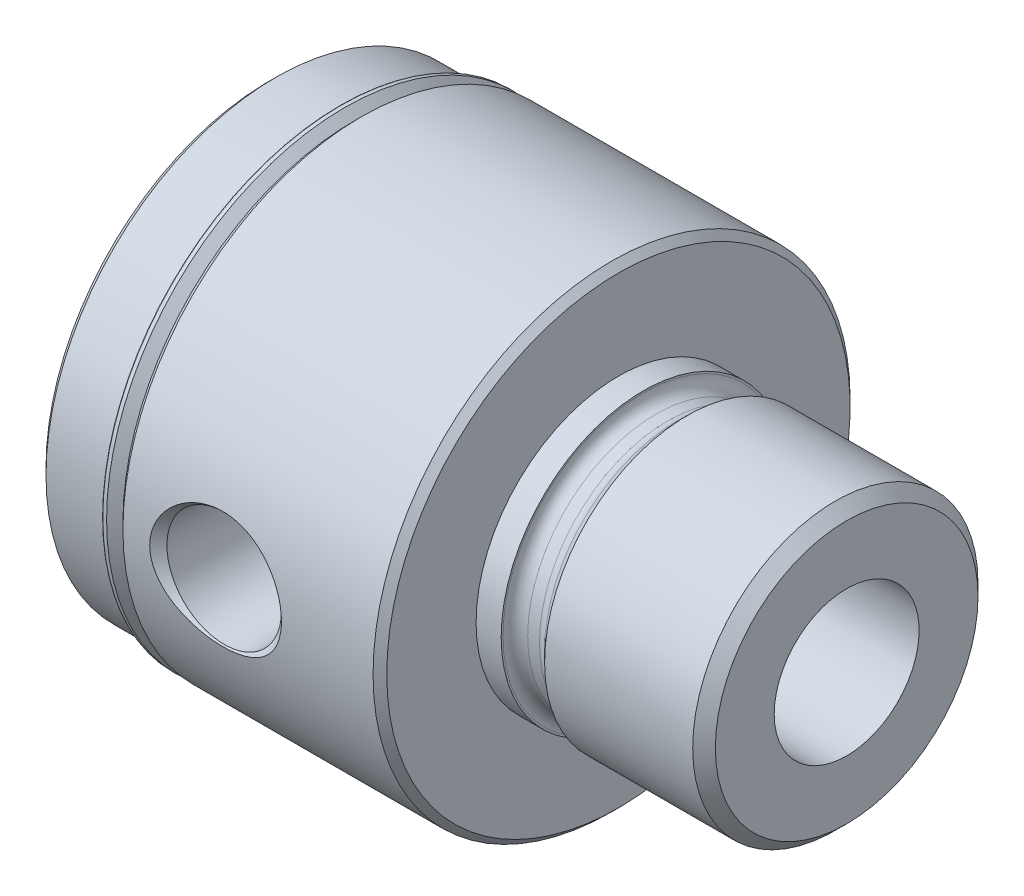
ISO-10303-21;
HEADER;
FILE_DESCRIPTION(('STEP AP214'),'2;1');
FILE_NAME('part.step','',(''),(''),'','','');
FILE_SCHEMA(('AUTOMOTIVE_DESIGN { 1 0 10303 214 1 1 1 1 }'));
ENDSEC;
DATA;
#1=APPLICATION_CONTEXT('core data for automotive mechanical design processes');
#2=APPLICATION_PROTOCOL_DEFINITION('international standard','automotive_design',2000,#1);
#3=PRODUCT_CONTEXT('',#1,'mechanical');
#4=PRODUCT('Part','Part','',(#3));
#5=PRODUCT_RELATED_PRODUCT_CATEGORY('part','',(#4));
#6=PRODUCT_DEFINITION_FORMATION('','',#4);
#7=PRODUCT_DEFINITION_CONTEXT('part definition',#1,'design');
#8=PRODUCT_DEFINITION('design','',#6,#7);
#9=PRODUCT_DEFINITION_SHAPE('','',#8);
#10=(LENGTH_UNIT() NAMED_UNIT(*) SI_UNIT(.MILLI.,.METRE.));
#11=(NAMED_UNIT(*) PLANE_ANGLE_UNIT() SI_UNIT($,.RADIAN.));
#12=(NAMED_UNIT(*) SI_UNIT($,.STERADIAN.) SOLID_ANGLE_UNIT());
#13=UNCERTAINTY_MEASURE_WITH_UNIT(LENGTH_MEASURE(1.E-05),#10,'distance_accuracy_value','');
#14=(GEOMETRIC_REPRESENTATION_CONTEXT(3) GLOBAL_UNCERTAINTY_ASSIGNED_CONTEXT((#13)) GLOBAL_UNIT_ASSIGNED_CONTEXT((#10,
#11,#12)) REPRESENTATION_CONTEXT('',''));
#15=CARTESIAN_POINT('',(0.,0.,0.));
#16=DIRECTION('',(0.,0.,1.));
#17=DIRECTION('',(1.,0.,0.));
#18=AXIS2_PLACEMENT_3D('',#15,#16,#17);
#19=CARTESIAN_POINT('',(25.3999999999999,14.6151600000002,0.));
#20=DIRECTION('',(-1.,0.,0.));
#21=DIRECTION('',(0.,0.,1.));
#22=AXIS2_PLACEMENT_3D('',#19,#20,#21);
#23=PLANE('',#22);
#24=CARTESIAN_POINT('',(25.3999999999997,0.,0.));
#25=DIRECTION('',(-1.,0.,0.));
#26=DIRECTION('',(0.,0.,1.));
#27=AXIS2_PLACEMENT_3D('',#24,#25,#26);
#28=CIRCLE('',#27,14.6151600000002);
#29=CARTESIAN_POINT('',(25.3999999999997,0.,14.6151600000002));
#30=VERTEX_POINT('',#29);
#31=EDGE_CURVE('E127',#30,#30,#28,.T.);
#32=ORIENTED_EDGE('',*,*,#31,.F.);
#33=EDGE_LOOP('',(#32));
#34=FACE_BOUND('',#33,.T.);
#35=CARTESIAN_POINT('',(25.3999999999999,0.,0.));
#36=DIRECTION('',(-1.,0.,0.));
#37=DIRECTION('',(0.,0.,1.));
#38=AXIS2_PLACEMENT_3D('',#35,#36,#37);
#39=CIRCLE('',#38,8.0645);
#40=CARTESIAN_POINT('',(25.3999999999999,0.,8.0645));
#41=VERTEX_POINT('',#40);
#42=EDGE_CURVE('E192',#41,#41,#39,.F.);
#43=ORIENTED_EDGE('',*,*,#42,.F.);
#44=EDGE_LOOP('',(#43));
#45=FACE_BOUND('',#44,.T.);
#46=ADVANCED_FACE('F37',(#34,#45),#23,.F.);
#47=CARTESIAN_POINT('',(-18.288,0.,25.585630358377));
#48=DIRECTION('',(0.,0.,1.));
#49=DIRECTION('',(1.,0.,0.));
#50=AXIS2_PLACEMENT_3D('',#47,#48,#49);
#51=CONICAL_SURFACE('',#50,6.372134104285,0.0312094049979733);
#52=CARTESIAN_POINT('',(-18.288,0.,25.585630358377));
#53=DIRECTION('',(0.,0.,-1.));
#54=DIRECTION('',(-1.,0.,0.));
#55=AXIS2_PLACEMENT_3D('',#52,#53,#54);
#56=CIRCLE('',#55,6.372134104285);
#57=CARTESIAN_POINT('',(-24.660134104285,0.,25.585630358377));
#58=VERTEX_POINT('',#57);
#59=EDGE_CURVE('E164',#58,#58,#56,.T.);
#60=ORIENTED_EDGE('',*,*,#59,.F.);
#61=EDGE_LOOP('',(#60));
#62=FACE_BOUND('',#61,.T.);
#63=CARTESIAN_POINT('',(-21.9422501595857,-4.48171558158441,6.70450488073481));
#64=CARTESIAN_POINT('',(-22.196372008943,-4.27994897936317,6.83936750431233));
#65=CARTESIAN_POINT('',(-22.4336210559118,-4.05680340199298,6.97528438821899));
#66=CARTESIAN_POINT('',(-22.8700643202903,-3.56981026332026,7.23666149597634));
#67=CARTESIAN_POINT('',(-23.0691838561952,-3.30588461860931,7.3621009330154));
#68=CARTESIAN_POINT('',(-23.3954329502363,-2.78342954880212,7.57333072807351));
#69=CARTESIAN_POINT('',(-23.528907814764,-2.53019923947508,7.66225001994694));
#70=CARTESIAN_POINT('',(-23.7007419960291,-2.1333665677312,7.77843088668593));
#71=CARTESIAN_POINT('',(-23.7532871929347,-1.99826970318068,7.81428923884346));
#72=CARTESIAN_POINT('',(-23.848309207216,-1.7230902352386,7.87953506384181));
#73=CARTESIAN_POINT('',(-23.8907905514358,-1.58300990620843,7.90892544563067));
#74=CARTESIAN_POINT('',(-23.96534700624,-1.29771604076106,7.96073303208243));
#75=CARTESIAN_POINT('',(-23.997344191961,-1.15247258219624,7.98309797073675));
#76=CARTESIAN_POINT('',(-24.0499801051286,-0.858948257056047,8.01999008149176));
#77=CARTESIAN_POINT('',(-24.070618745053,-0.710667367085128,8.03451719319874));
#78=CARTESIAN_POINT('',(-24.1001600522482,-0.412409010940775,8.05533490306841));
#79=CARTESIAN_POINT('',(-24.1090662873288,-0.262432074532019,8.06162800517929));
#80=CARTESIAN_POINT('',(-24.1149852464749,0.0378657641243334,8.06580858509963));
#81=CARTESIAN_POINT('',(-24.1119991436807,0.188186630982284,8.06369689201472));
#82=CARTESIAN_POINT('',(-24.0952110184629,0.470694750494254,8.0518485493925));
#83=CARTESIAN_POINT('',(-24.0826792392453,0.602997879113977,8.04300747507597));
#84=CARTESIAN_POINT('',(-24.0485064637167,0.865880396294678,8.01896742261519));
#85=CARTESIAN_POINT('',(-24.026862470281,0.996459203116397,8.00376635259659));
#86=CARTESIAN_POINT('',(-23.97476705113,1.25494476231362,7.96732694724235));
#87=CARTESIAN_POINT('',(-23.9443184063471,1.38285234473417,7.94609051819975));
#88=CARTESIAN_POINT('',(-23.8750011057141,1.63530420042985,7.89800529363593));
#89=CARTESIAN_POINT('',(-23.8361291844322,1.75984714822691,7.87115432167984));
#90=CARTESIAN_POINT('',(-23.7057042825478,2.132601516823,7.78165809233401));
#91=CARTESIAN_POINT('',(-23.6014410983141,2.37455810887627,7.71085315471211));
#92=CARTESIAN_POINT('',(-23.3636935317072,2.83752365200895,7.55279139058956));
#93=CARTESIAN_POINT('',(-23.2302032326687,3.05852834863805,7.46553123343149));
#94=CARTESIAN_POINT('',(-22.9150149557631,3.50997263811297,7.26541141917605));
#95=CARTESIAN_POINT('',(-22.7290560097915,3.73660015128647,7.15067943056018));
#96=CARTESIAN_POINT('',(-22.3268948839036,4.1578157449633,6.91427129086302));
#97=CARTESIAN_POINT('',(-22.1106387865548,4.352345328981,6.79258299388632));
#98=CARTESIAN_POINT('',(-21.7454412804759,4.63436349385094,6.60112484624974));
#99=CARTESIAN_POINT('',(-21.6053586827753,4.73298821109639,6.53057002412192));
#100=CARTESIAN_POINT('',(-21.3159392918616,4.91810782791032,6.39231611808872));
#101=CARTESIAN_POINT('',(-21.1665999794469,5.00459940437839,6.32461782008207));
#102=CARTESIAN_POINT('',(-20.8593083890511,5.16466780430813,6.1945932354079));
#103=CARTESIAN_POINT('',(-20.7013723798135,5.23826798159825,6.1322573408177));
#104=CARTESIAN_POINT('',(-20.3770126442403,5.3719426054678,6.01550262950323));
#105=CARTESIAN_POINT('',(-20.2105904101721,5.43201942008321,5.96108242727694));
#106=CARTESIAN_POINT('',(-19.9249430054809,5.52059004199174,5.87891423285597));
#107=CARTESIAN_POINT('',(-19.8077750040948,5.55302465603974,5.84822019565179));
#108=CARTESIAN_POINT('',(-19.5703429749224,5.61083333618821,5.79278129616531));
#109=CARTESIAN_POINT('',(-19.4500799000395,5.63620954766067,5.76803462651708));
#110=CARTESIAN_POINT('',(-19.2072004213735,5.67952388626195,5.72539035663426));
#111=CARTESIAN_POINT('',(-19.0845877473938,5.69747292118764,5.70748271537881));
#112=CARTESIAN_POINT('',(-18.8376556137315,5.72568317054587,5.67918255245426));
#113=CARTESIAN_POINT('',(-18.7133367972676,5.73594720533166,5.66878727383774));
#114=CARTESIAN_POINT('',(-18.4632867041914,5.74863484981437,5.65592093606921));
#115=CARTESIAN_POINT('',(-18.3375515159012,5.75102072630692,5.65348801388727));
#116=CARTESIAN_POINT('',(-18.0862945586574,5.74779843277445,5.65676392677301));
#117=CARTESIAN_POINT('',(-17.9607727854718,5.74219042315971,5.6624725984664));
#118=CARTESIAN_POINT('',(-17.7108515804586,5.72308386015072,5.68178262632165));
#119=CARTESIAN_POINT('',(-17.5864531063521,5.70957912011648,5.69539017074088));
#120=CARTESIAN_POINT('',(-17.3397135493458,5.67491383242121,5.72993088483851));
#121=CARTESIAN_POINT('',(-17.217373526798,5.6537494582821,5.75086771579382));
#122=CARTESIAN_POINT('',(-16.9533666768235,5.59954837833582,5.80369714146477));
#123=CARTESIAN_POINT('',(-16.8122612737708,5.56504761757921,5.83689364061704));
#124=CARTESIAN_POINT('',(-16.5347540914374,5.48637802937761,5.91089901030021));
#125=CARTESIAN_POINT('',(-16.3983557132373,5.44220237387437,5.95171325403378));
#126=CARTESIAN_POINT('',(-16.1306330131764,5.34469027103046,6.03943298256754));
#127=CARTESIAN_POINT('',(-15.9993177767854,5.2913382716638,6.0863487747768));
#128=CARTESIAN_POINT('',(-15.7423582732087,5.17604397829774,6.18469640633433));
#129=CARTESIAN_POINT('',(-15.6167121805708,5.1141044760005,6.23612677605806));
#130=CARTESIAN_POINT('',(-15.3391320564748,4.96474537761093,6.35601013852087));
#131=CARTESIAN_POINT('',(-15.1889057516377,4.87489655882523,6.42540011132712));
#132=CARTESIAN_POINT('',(-14.8979620476536,4.68269783652749,6.56679101956988));
#133=CARTESIAN_POINT('',(-14.757246862009,4.58034503844461,6.63879255684002));
#134=CARTESIAN_POINT('',(-14.4856227791063,4.36347550226449,6.78330545889964));
#135=CARTESIAN_POINT('',(-14.3547204610628,4.2489507254591,6.85581713070972));
#136=CARTESIAN_POINT('',(-14.1033665136231,4.00811514537004,6.99934451417421));
#137=CARTESIAN_POINT('',(-13.9829139265194,3.88180542437165,7.07036036246669));
#138=CARTESIAN_POINT('',(-13.752621298039,3.6170607937716,7.20940318441205));
#139=CARTESIAN_POINT('',(-13.6428352114736,3.47857037159048,7.27741410059186));
#140=CARTESIAN_POINT('',(-13.4354900442913,3.1903854213332,7.40828198885991));
#141=CARTESIAN_POINT('',(-13.3379322231325,3.04068974169628,7.47113842982953));
#142=CARTESIAN_POINT('',(-13.1564273431087,2.73108243313005,7.58978076832249));
#143=CARTESIAN_POINT('',(-13.0724507936247,2.57119401959209,7.64558192667194));
#144=CARTESIAN_POINT('',(-12.919184162882,2.24189612565094,7.74853397151354));
#145=CARTESIAN_POINT('',(-12.8498875530055,2.07249092024526,7.79568870207685));
#146=CARTESIAN_POINT('',(-12.7445406912567,1.77433826359201,7.86793300171374));
#147=CARTESIAN_POINT('',(-12.7046200279603,1.64754320679563,7.89549942988241));
#148=CARTESIAN_POINT('',(-12.6335207566146,1.39042813520721,7.94480899928316));
#149=CARTESIAN_POINT('',(-12.602340220523,1.26010890480192,7.96655342478173));
#150=CARTESIAN_POINT('',(-12.5491410507229,0.996799745731224,8.00376292632248));
#151=CARTESIAN_POINT('',(-12.5271175962026,0.863811261070616,8.01923130633011));
#152=CARTESIAN_POINT('',(-12.4925219759595,0.596001992973566,8.04357001421153));
#153=CARTESIAN_POINT('',(-12.4799501490726,0.46118114402418,8.05244010553991));
#154=CARTESIAN_POINT('',(-12.4644328647609,0.190416892381912,8.06339251586877));
#155=CARTESIAN_POINT('',(-12.4615082426018,0.0544716949055756,8.06546014342367));
#156=CARTESIAN_POINT('',(-12.4653891659584,-0.217208966336272,8.06271884803365));
#157=CARTESIAN_POINT('',(-12.47219467123,-0.352944430966919,8.0579099535302));
#158=CARTESIAN_POINT('',(-12.4954307273775,-0.623173341664994,8.04152590928348));
#159=CARTESIAN_POINT('',(-12.5118612750088,-0.757666788151087,8.0299507618211));
#160=CARTESIAN_POINT('',(-12.554109992237,-1.02448865681501,8.0002882562193));
#161=CARTESIAN_POINT('',(-12.5799317781881,-1.15681622442089,7.98219838943467));
#162=CARTESIAN_POINT('',(-12.639764373569,-1.41476002975439,7.94047884148105));
#163=CARTESIAN_POINT('',(-12.6735287945203,-1.5404606543692,7.91701631634226));
#164=CARTESIAN_POINT('',(-12.7491867247477,-1.78826986489332,7.86475146006652));
#165=CARTESIAN_POINT('',(-12.7910830361064,-1.91037719587703,7.83594728846065));
#166=CARTESIAN_POINT('',(-12.9282900747729,-2.27033417583391,7.74229092303298));
#167=CARTESIAN_POINT('',(-13.03516283067,-2.50200468621413,7.67016370247278));
#168=CARTESIAN_POINT('',(-13.2892758871211,-2.96974953878362,7.50235288987844));
#169=CARTESIAN_POINT('',(-13.4396817309467,-3.20345397994072,7.40494252895656));
#170=CARTESIAN_POINT('',(-13.7695939144871,-3.64385483809687,7.19844758874757));
#171=CARTESIAN_POINT('',(-13.9491277851719,-3.8505253663187,7.08935199839687));
#172=CARTESIAN_POINT('',(-14.2556445382452,-4.15696975001748,6.91181742988414));
#173=CARTESIAN_POINT('',(-14.3743508855409,-4.26606475978297,6.84486430616523));
#174=CARTESIAN_POINT('',(-14.6203915113959,-4.47394413773863,6.71083137794828));
#175=CARTESIAN_POINT('',(-14.7477239861791,-4.57273065059054,6.64375160276829));
#176=CARTESIAN_POINT('',(-15.0107602936763,-4.75975358398768,6.51107180968746));
#177=CARTESIAN_POINT('',(-15.1464678390692,-4.84798527389675,6.44547246591855));
#178=CARTESIAN_POINT('',(-15.4258612521065,-5.01341456812903,6.31765544824837));
#179=CARTESIAN_POINT('',(-15.5695453016253,-5.09061467271636,6.255437010066));
#180=CARTESIAN_POINT('',(-15.9554810164921,-5.27737097715479,6.09983406521145));
#181=CARTESIAN_POINT('',(-16.2041550241278,-5.37774596044268,6.01072893449566));
#182=CARTESIAN_POINT('',(-16.5903762731684,-5.5031078230053,5.89535522545197));
#183=CARTESIAN_POINT('',(-16.7212569984866,-5.54068384403026,5.8599563874557));
#184=CARTESIAN_POINT('',(-16.9869626642676,-5.60698710837373,5.79654709122958));
#185=CARTESIAN_POINT('',(-17.1217850104745,-5.63572003450786,5.76853188974213));
#186=CARTESIAN_POINT('',(-17.3743806125875,-5.6802891157809,5.72462270769043));
#187=CARTESIAN_POINT('',(-17.4917245517673,-5.69740451812099,5.70754852633508));
#188=CARTESIAN_POINT('',(-17.7279768529647,-5.7245984217418,5.68027347129171));
#189=CARTESIAN_POINT('',(-17.8468844668206,-5.73468017189506,5.67006942433691));
#190=CARTESIAN_POINT('',(-18.0854350088759,-5.7476407967721,5.65693133363145));
#191=CARTESIAN_POINT('',(-18.2050775330434,-5.75052332632843,5.65399360099406));
#192=CARTESIAN_POINT('',(-18.4442734340169,-5.74904474203858,5.65549689374269));
#193=CARTESIAN_POINT('',(-18.5638268084625,-5.74468344277373,5.65993810800599));
#194=CARTESIAN_POINT('',(-18.8016763901597,-5.72881309361417,5.67600112200179));
#195=CARTESIAN_POINT('',(-18.9199749419365,-5.71732139148264,5.68760549392848));
#196=CARTESIAN_POINT('',(-19.1548524987025,-5.68739887115844,5.71752478736541));
#197=CARTESIAN_POINT('',(-19.2714308602345,-5.6689655214801,5.73584215691165));
#198=CARTESIAN_POINT('',(-19.6178772683966,-5.60358535495474,5.7999822130965));
#199=CARTESIAN_POINT('',(-19.8442054018516,-5.54657597377915,5.8549736710655));
#200=CARTESIAN_POINT('',(-20.3711842331879,-5.3807635720162,6.00837947825581));
#201=CARTESIAN_POINT('',(-20.6656717539482,-5.26038379922488,6.11536557140795));
#202=CARTESIAN_POINT('',(-21.0851403479864,-5.04877315236547,6.28923415514428));
#203=CARTESIAN_POINT('',(-21.2212558824108,-4.97306049636259,6.34942359210883));
#204=CARTESIAN_POINT('',(-21.4860819020381,-4.81164316449929,6.47259712689819));
#205=CARTESIAN_POINT('',(-21.6147965978348,-4.72594425587566,6.53557959880414));
#206=CARTESIAN_POINT('',(-21.8083472415235,-4.58565873361476,6.63412534944275));
#207=CARTESIAN_POINT('',(-21.8758742650346,-4.53441643649651,6.66927915219512));
#208=CARTESIAN_POINT('',(-21.9422501595857,-4.48171558158441,6.70450488073481));
#209=B_SPLINE_CURVE_WITH_KNOTS('',3,(#63,#64,#65,#66,#67,#68,#69,#70,#71,#72,#73,#74,#75,#76,
#77,#78,#79,#80,#81,#82,#83,#84,#85,#86,#87,#88,#89,#90,#91,#92,#93,#94,#95,#96,#97,#98,#99,
#100,#101,#102,#103,#104,#105,#106,#107,#108,#109,#110,#111,#112,#113,#114,#115,#116,#117,#118,
#119,#120,#121,#122,#123,#124,#125,#126,#127,#128,#129,#130,#131,#132,#133,#134,#135,#136,#137,
#138,#139,#140,#141,#142,#143,#144,#145,#146,#147,#148,#149,#150,#151,#152,#153,#154,#155,#156,
#157,#158,#159,#160,#161,#162,#163,#164,#165,#166,#167,#168,#169,#170,#171,#172,#173,#174,#175,
#176,#177,#178,#179,#180,#181,#182,#183,#184,#185,#186,#187,#188,#189,#190,#191,#192,#193,#194,
#195,#196,#197,#198,#199,#200,#201,#202,#203,#204,#205,#206,#207,#208),.UNSPECIFIED.,.T.,.F.,(4,
2,2,2,2,2,2,2,2,2,2,2,2,2,2,2,2,2,2,2,2,2,2,2,2,2,2,2,2,2,2,2,2,2,2,2,2,2,2,2,2,2,2,2,2,2,2,2,2,
2,2,2,2,2,2,2,2,2,2,2,2,2,2,2,2,2,2,2,2,2,2,2,4),(0.,1.05392203166613,2.10988765060508,
3.00504198227542,3.45254501700583,3.89984637555721,4.35040068141068,4.80095845892291,
5.25137919072025,5.70175549108362,6.10085075243676,6.50007738404703,6.89917805815653,
7.29843372837126,8.1133995577227,8.92853051954809,9.86952071119059,10.8122072981011,
11.3674927884252,11.9229300681115,12.4773504795213,13.0316737323628,13.407511360459,
13.7832346291372,14.1584041228028,14.5334358637271,14.9102612699756,15.2870791147182,
15.6641925711372,16.0414946805308,16.487860634997,16.9345426333112,17.3819892632905,
17.8292907729143,18.3934487620592,18.9577375976054,19.5224014483525,20.0870134934259,
20.6543471574084,21.2217392063532,21.7878821696904,22.3537728208949,22.7606397036154,
23.1674167621233,23.5739793979292,23.980556608103,24.3880113384785,24.7954643836158,
25.2029172914022,25.6105272665319,26.006857474595,26.4033244931479,27.195684128914,
28.0760683382185,28.957289561484,29.4805593099231,30.0037199751967,30.5271142477217,
31.0503897062621,31.8944842311426,32.3161550166521,32.737554256386,33.0965968552286,
33.4554735008377,33.8141679182621,34.1728715172493,34.5307058193762,34.8886707433777,
35.6053493490013,36.6065349728119,37.1071527602995,37.6074828518545,37.8827642486171),.UNSPECIFIED.);
#210=CARTESIAN_POINT('',(-21.9422501595857,-4.48171558158441,6.70450488073481));
#211=VERTEX_POINT('',#210);
#212=EDGE_CURVE('E195',#211,#211,#209,.T.);
#213=ORIENTED_EDGE('',*,*,#212,.T.);
#214=EDGE_LOOP('',(#213));
#215=FACE_BOUND('',#214,.T.);
#216=ADVANCED_FACE('F72',(#62,#215),#51,.F.);
#217=CARTESIAN_POINT('',(-38.8874,0.,0.));
#218=DIRECTION('',(1.,0.,0.));
#219=DIRECTION('',(0.,0.,-1.));
#220=AXIS2_PLACEMENT_3D('',#217,#218,#219);
#221=PLANE('',#220);
#222=CARTESIAN_POINT('',(-38.8874,0.,0.));
#223=DIRECTION('',(-1.,0.,0.));
#224=DIRECTION('',(0.,0.,1.));
#225=AXIS2_PLACEMENT_3D('',#222,#223,#224);
#226=CIRCLE('',#225,24.8158);
#227=CARTESIAN_POINT('',(-38.8874,0.,24.8158));
#228=VERTEX_POINT('',#227);
#229=EDGE_CURVE('E152',#228,#228,#226,.T.);
#230=ORIENTED_EDGE('',*,*,#229,.T.);
#231=EDGE_LOOP('',(#230));
#232=FACE_BOUND('',#231,.T.);
#233=CARTESIAN_POINT('',(-38.8874,0.,0.));
#234=DIRECTION('',(-1.,0.,0.));
#235=DIRECTION('',(0.,0.,1.));
#236=AXIS2_PLACEMENT_3D('',#233,#234,#235);
#237=CIRCLE('',#236,8.0645);
#238=CARTESIAN_POINT('',(-38.8874,0.,8.0645));
#239=VERTEX_POINT('',#238);
#240=EDGE_CURVE('E201',#239,#239,#237,.T.);
#241=ORIENTED_EDGE('',*,*,#240,.F.);
#242=EDGE_LOOP('',(#241));
#243=FACE_BOUND('',#242,.T.);
#244=ADVANCED_FACE('F39',(#232,#243),#221,.F.);
#245=CARTESIAN_POINT('',(-29.3624,24.511,0.));
#246=DIRECTION('',(1.,0.,0.));
#247=DIRECTION('',(0.,0.,-1.));
#248=AXIS2_PLACEMENT_3D('',#245,#246,#247);
#249=PLANE('',#248);
#250=CARTESIAN_POINT('',(-29.3624,0.,0.));
#251=DIRECTION('',(-1.,0.,0.));
#252=DIRECTION('',(0.,0.,1.));
#253=AXIS2_PLACEMENT_3D('',#250,#251,#252);
#254=CIRCLE('',#253,25.781);
#255=CARTESIAN_POINT('',(-29.3624,0.,25.781));
#256=VERTEX_POINT('',#255);
#257=EDGE_CURVE('E138',#256,#256,#254,.T.);
#258=ORIENTED_EDGE('',*,*,#257,.T.);
#259=EDGE_LOOP('',(#258));
#260=FACE_BOUND('',#259,.T.);
#261=CARTESIAN_POINT('',(-29.3624,0.,0.));
#262=DIRECTION('',(1.,0.,0.));
#263=DIRECTION('',(0.,0.,-1.));
#264=AXIS2_PLACEMENT_3D('',#261,#262,#263);
#265=CIRCLE('',#264,25.383935322151);
#266=CARTESIAN_POINT('',(-29.3624,0.,-25.383935322151));
#267=VERTEX_POINT('',#266);
#268=EDGE_CURVE('E44',#267,#267,#265,.F.);
#269=ORIENTED_EDGE('',*,*,#268,.F.);
#270=EDGE_LOOP('',(#269));
#271=FACE_BOUND('',#270,.T.);
#272=ADVANCED_FACE('F243',(#260,#271),#249,.F.);
#273=CARTESIAN_POINT('',(0.,0.,0.));
#274=DIRECTION('',(-1.,0.,0.));
#275=DIRECTION('',(0.,0.,1.));
#276=AXIS2_PLACEMENT_3D('',#273,#274,#275);
#277=CYLINDRICAL_SURFACE('',#276,26.543);
#278=CARTESIAN_POINT('',(-0.762,0.,0.));
#279=DIRECTION('',(-1.,0.,0.));
#280=DIRECTION('',(0.,0.,1.));
#281=AXIS2_PLACEMENT_3D('',#278,#279,#280);
#282=CIRCLE('',#281,26.543);
#283=CARTESIAN_POINT('',(-0.762,0.,26.543));
#284=VERTEX_POINT('',#283);
#285=EDGE_CURVE('E123',#284,#284,#282,.T.);
#286=ORIENTED_EDGE('',*,*,#285,.T.);
#287=EDGE_LOOP('',(#286));
#288=FACE_BOUND('',#287,.T.);
#289=CARTESIAN_POINT('',(-28.6004,0.,0.));
#290=DIRECTION('',(-1.,0.,0.));
#291=DIRECTION('',(0.,0.,1.));
#292=AXIS2_PLACEMENT_3D('',#289,#290,#291);
#293=CIRCLE('',#292,26.543);
#294=CARTESIAN_POINT('',(-28.6004,0.,26.543));
#295=VERTEX_POINT('',#294);
#296=EDGE_CURVE('E129',#295,#295,#293,.T.);
#297=ORIENTED_EDGE('',*,*,#296,.F.);
#298=EDGE_LOOP('',(#297));
#299=FACE_BOUND('',#298,.T.);
#300=CARTESIAN_POINT('',(-23.2383380595666,-4.79606006972595,26.1061038228147));
#301=CARTESIAN_POINT('',(-23.0760235956255,-4.92860360509776,26.0817539710612));
#302=CARTESIAN_POINT('',(-22.9078660997341,-5.05400855578927,26.0576731030959));
#303=CARTESIAN_POINT('',(-22.5612759884357,-5.29012407797535,26.0107656680022));
#304=CARTESIAN_POINT('',(-22.3828393493931,-5.40082883845888,25.987939598975));
#305=CARTESIAN_POINT('',(-22.0169391586199,-5.60722444536706,25.9441907148895));
#306=CARTESIAN_POINT('',(-21.8294632743127,-5.70289397510874,25.9232706194244));
#307=CARTESIAN_POINT('',(-21.4470445794762,-5.87873047679977,25.8839621870108));
#308=CARTESIAN_POINT('',(-21.2520990658885,-5.95889177203191,25.8655747778469));
#309=CARTESIAN_POINT('',(-20.8554230347269,-6.10366239336771,25.831796365284));
#310=CARTESIAN_POINT('',(-20.6536695502717,-6.16821146787474,25.8164170130783));
#311=CARTESIAN_POINT('',(-20.2454518506335,-6.28113146116921,25.7891762558812));
#312=CARTESIAN_POINT('',(-20.0389875499731,-6.32950208615054,25.7773149147785));
#313=CARTESIAN_POINT('',(-19.6227748306099,-6.40987362938154,25.7574471628509));
#314=CARTESIAN_POINT('',(-19.4130273374081,-6.44187907812852,25.7494396851675));
#315=CARTESIAN_POINT('',(-18.9916221095036,-6.48941231748874,25.7375013663801));
#316=CARTESIAN_POINT('',(-18.7799649345425,-6.50494478773398,25.7335693675241));
#317=CARTESIAN_POINT('',(-18.3467623624246,-6.51980587217351,25.7298085520752));
#318=CARTESIAN_POINT('',(-18.1251896107311,-6.51839557288225,25.7301668428153));
#319=CARTESIAN_POINT('',(-17.682940418492,-6.49757964316707,25.735431231784));
#320=CARTESIAN_POINT('',(-17.4622640076831,-6.47817342053797,25.7403374796756));
#321=CARTESIAN_POINT('',(-17.0233467415618,-6.42144335056615,25.7545485106689));
#322=CARTESIAN_POINT('',(-16.805106103038,-6.38411792118723,25.763853682138));
#323=CARTESIAN_POINT('',(-16.3725623923559,-6.29168887825165,25.7865810200411));
#324=CARTESIAN_POINT('',(-16.1582607425784,-6.2365789709789,25.8000046438636));
#325=CARTESIAN_POINT('',(-15.7345669815162,-6.108599515551,25.8306060848778));
#326=CARTESIAN_POINT('',(-15.5251917369627,-6.03567659611801,25.8477951678452));
#327=CARTESIAN_POINT('',(-15.1135927863576,-5.87245352674332,25.8853647292947));
#328=CARTESIAN_POINT('',(-14.9113719220639,-5.78214656149887,25.9057464588477));
#329=CARTESIAN_POINT('',(-14.3179779858443,-5.48567202943245,25.9707436678962));
#330=CARTESIAN_POINT('',(-13.9396387350161,-5.25382028150253,26.0192445031197));
#331=CARTESIAN_POINT('',(-13.2420134206161,-4.73322676224216,26.1188642132428));
#332=CARTESIAN_POINT('',(-12.9213079711039,-4.44637766242892,26.169862665135));
#333=CARTESIAN_POINT('',(-12.4849330201965,-3.97493408787922,26.2441632739972));
#334=CARTESIAN_POINT('',(-12.3468770943348,-3.81085302595622,26.2685729952456));
#335=CARTESIAN_POINT('',(-12.0873849411535,-3.46988109822201,26.3157812052067));
#336=CARTESIAN_POINT('',(-11.9659380390665,-3.29299857289348,26.3385807242099));
#337=CARTESIAN_POINT('',(-11.7524069325733,-2.94549144210344,26.3795846389763));
#338=CARTESIAN_POINT('',(-11.6586135631294,-2.77594220399039,26.3980203421186));
#339=CARTESIAN_POINT('',(-11.4873338918057,-2.42863619201602,26.4322338665653));
#340=CARTESIAN_POINT('',(-11.4098379044993,-2.25088436993306,26.4480132653749));
#341=CARTESIAN_POINT('',(-11.2723468362194,-1.88862666579608,26.4763463850697));
#342=CARTESIAN_POINT('',(-11.2123387885326,-1.70412590268823,26.488902495087));
#343=CARTESIAN_POINT('',(-11.1107785472465,-1.32990597600798,26.51032435368));
#344=CARTESIAN_POINT('',(-11.069223685853,-1.14018757096908,26.519190635686));
#345=CARTESIAN_POINT('',(-11.0095345594789,-0.782633025505201,26.5319807665985));
#346=CARTESIAN_POINT('',(-10.9890365257969,-0.615205727238013,26.536401757754));
#347=CARTESIAN_POINT('',(-10.9628070269957,-0.279081429787433,26.5420651236606));
#348=CARTESIAN_POINT('',(-10.9570804513905,-0.110384028713075,26.5433064459056));
#349=CARTESIAN_POINT('',(-10.9605014080117,0.226743580172554,26.5425660296895));
#350=CARTESIAN_POINT('',(-10.9696386077784,0.395173892193064,26.5405865301623));
#351=CARTESIAN_POINT('',(-11.0026139256462,0.7305408558769,26.5334764607571));
#352=CARTESIAN_POINT('',(-11.0264574765529,0.897476932409617,26.5283447263866));
#353=CARTESIAN_POINT('',(-11.1158493781241,1.37394447025664,26.5092342850136));
#354=CARTESIAN_POINT('',(-11.1996340357802,1.68009306621228,26.491443793923));
#355=CARTESIAN_POINT('',(-11.4141084228445,2.27453523007438,26.4470517566859));
#356=CARTESIAN_POINT('',(-11.5448048332242,2.56282624792005,26.4204489555695));
#357=CARTESIAN_POINT('',(-11.8554976085431,3.12987834318403,26.3594402887827));
#358=CARTESIAN_POINT('',(-12.0376566320256,3.40741616595892,26.3247073167892));
#359=CARTESIAN_POINT('',(-12.4412603133965,3.93165141268861,26.2515371595317));
#360=CARTESIAN_POINT('',(-12.6627212706441,4.17833596848857,26.2130984404473));
#361=CARTESIAN_POINT('',(-13.166071485202,4.66429430291143,26.1312616303576));
#362=CARTESIAN_POINT('',(-13.4519923561449,4.8993753219857,26.0878063249484));
#363=CARTESIAN_POINT('',(-14.0564425852555,5.32407891815024,26.0044616190017));
#364=CARTESIAN_POINT('',(-14.3749875441318,5.51367960052352,25.9645739417298));
#365=CARTESIAN_POINT('',(-14.889800862108,5.77162588136506,25.9080686964585));
#366=CARTESIAN_POINT('',(-15.0777362615871,5.85648222882308,25.8889694333732));
#367=CARTESIAN_POINT('',(-15.4599375475754,6.01114109251801,25.8534977738861));
#368=CARTESIAN_POINT('',(-15.654201849128,6.08094734491823,25.837124700942));
#369=CARTESIAN_POINT('',(-16.0478918385603,6.20530178111633,25.8075408362477));
#370=CARTESIAN_POINT('',(-16.2473202800479,6.25984163363308,25.7943317717463));
#371=CARTESIAN_POINT('',(-16.6499145202269,6.353416564318,25.7714428625301));
#372=CARTESIAN_POINT('',(-16.8530791579696,6.39245637640282,25.7617619403483));
#373=CARTESIAN_POINT('',(-17.2743258503726,6.45680555719805,25.7457119692187));
#374=CARTESIAN_POINT('',(-17.4925663393888,6.48114050686541,25.7395789252614));
#375=CARTESIAN_POINT('',(-17.9303837540462,6.51213817181078,25.7317539230286));
#376=CARTESIAN_POINT('',(-18.149960737542,6.51880011652202,25.7300621583989));
#377=CARTESIAN_POINT('',(-18.588914059972,6.51442267821391,25.7311708192778));
#378=CARTESIAN_POINT('',(-18.8082904106877,6.50338441162171,25.7339709614629));
#379=CARTESIAN_POINT('',(-19.2454149438655,6.46364744014338,25.743980444533));
#380=CARTESIAN_POINT('',(-19.4631625193756,6.434942454277,25.7511913535553));
#381=CARTESIAN_POINT('',(-19.8982743505627,6.35949140552114,25.769929155027));
#382=CARTESIAN_POINT('',(-20.115596090551,6.31251357153479,25.781511435104));
#383=CARTESIAN_POINT('',(-20.5454417802101,6.20071558536927,25.8086280497645));
#384=CARTESIAN_POINT('',(-20.7579638292167,6.13588849448029,25.8241639210865));
#385=CARTESIAN_POINT('',(-21.1764970621391,5.98867390666947,25.8586996086973));
#386=CARTESIAN_POINT('',(-21.3825097050382,5.90629037727492,25.8776986422164));
#387=CARTESIAN_POINT('',(-21.7865775015763,5.72422950459552,25.9185792479617));
#388=CARTESIAN_POINT('',(-21.984628818026,5.62454394232146,25.9404621889366));
#389=CARTESIAN_POINT('',(-22.3683221937961,5.40981307727629,25.9860855850723));
#390=CARTESIAN_POINT('',(-22.5540994421456,5.29500308406149,26.0097956459597));
#391=CARTESIAN_POINT('',(-22.9145983936324,5.04943218370289,26.0585830017173));
#392=CARTESIAN_POINT('',(-23.0893210643142,4.91867267547106,26.0836601765731));
#393=CARTESIAN_POINT('',(-23.4260636679036,4.64172581872576,26.134365223246));
#394=CARTESIAN_POINT('',(-23.5880815136018,4.49553594445434,26.1599931846717));
#395=CARTESIAN_POINT('',(-23.8975194381459,4.18852801448937,26.210899772997));
#396=CARTESIAN_POINT('',(-24.0449480423741,4.02771860856581,26.2361785963984));
#397=CARTESIAN_POINT('',(-24.3136353237644,3.70413508382413,26.283741222445));
#398=CARTESIAN_POINT('',(-24.4360058694803,3.54229712205544,26.3061105692767));
#399=CARTESIAN_POINT('',(-24.6650258836344,3.2077311318128,26.3489985332523));
#400=CARTESIAN_POINT('',(-24.7716843368867,3.03500940843613,26.3695182054893));
#401=CARTESIAN_POINT('',(-24.9677592325195,2.67991896656599,26.4079674270998));
#402=CARTESIAN_POINT('',(-25.0571886492345,2.49755764011091,26.4258989229285));
#403=CARTESIAN_POINT('',(-25.2174463611792,2.12455712307777,26.4584981250415));
#404=CARTESIAN_POINT('',(-25.2882777976609,1.93391933676443,26.4731663824323));
#405=CARTESIAN_POINT('',(-25.4021234402376,1.57145992055382,26.4969794579132));
#406=CARTESIAN_POINT('',(-25.4475609460369,1.40042749686713,26.5065951768577));
#407=CARTESIAN_POINT('',(-25.522744990549,1.0548093007267,26.5225968617788));
#408=CARTESIAN_POINT('',(-25.5524935908653,0.880223998272583,26.5289832521014));
#409=CARTESIAN_POINT('',(-25.5958179895671,0.52905371342141,26.5383073553013));
#410=CARTESIAN_POINT('',(-25.6094030745411,0.352469938162145,26.5412470484303));
#411=CARTESIAN_POINT('',(-25.6202315913242,-0.00116717967722327,26.5435905453847));
#412=CARTESIAN_POINT('',(-25.6174759878872,-0.178220493918845,26.5429945579566));
#413=CARTESIAN_POINT('',(-25.5867931022419,-0.673514735532778,26.5363581717998));
#414=CARTESIAN_POINT('',(-25.5403994267609,-0.990753734184425,26.5263236393589));
#415=CARTESIAN_POINT('',(-25.3966439518335,-1.61274030517711,26.4957964138563));
#416=CARTESIAN_POINT('',(-25.2992718961953,-1.91748535058765,26.4753016163451));
#417=CARTESIAN_POINT('',(-25.0566252244458,-2.51089380415579,26.4256706725816));
#418=CARTESIAN_POINT('',(-24.910764484603,-2.79930724194233,26.3964292548016));
#419=CARTESIAN_POINT('',(-24.5773946868599,-3.34995335607976,26.3322156175464));
#420=CARTESIAN_POINT('',(-24.3899061672748,-3.61219885100839,26.2972462263627));
#421=CARTESIAN_POINT('',(-24.042713059069,-4.03046704476374,26.2357804429728));
#422=CARTESIAN_POINT('',(-23.8921956160155,-4.19435473438861,26.2099855493256));
#423=CARTESIAN_POINT('',(-23.5760892566278,-4.50685860281434,26.1580608388426));
#424=CARTESIAN_POINT('',(-23.4105004356921,-4.65547487826723,26.1319310241275));
#425=CARTESIAN_POINT('',(-23.2383380595666,-4.79606006972595,26.1061038228147));
#426=B_SPLINE_CURVE_WITH_KNOTS('',3,(#300,#301,#302,#303,#304,#305,#306,#307,#308,#309,#310,
#311,#312,#313,#314,#315,#316,#317,#318,#319,#320,#321,#322,#323,#324,#325,#326,#327,#328,#329,
#330,#331,#332,#333,#334,#335,#336,#337,#338,#339,#340,#341,#342,#343,#344,#345,#346,#347,#348,
#349,#350,#351,#352,#353,#354,#355,#356,#357,#358,#359,#360,#361,#362,#363,#364,#365,#366,#367,
#368,#369,#370,#371,#372,#373,#374,#375,#376,#377,#378,#379,#380,#381,#382,#383,#384,#385,#386,
#387,#388,#389,#390,#391,#392,#393,#394,#395,#396,#397,#398,#399,#400,#401,#402,#403,#404,#405,
#406,#407,#408,#409,#410,#411,#412,#413,#414,#415,#416,#417,#418,#419,#420,#421,#422,#423,#424,
#425),.UNSPECIFIED.,.T.,.F.,(4,2,2,2,2,2,2,2,2,2,2,2,2,2,2,2,2,2,2,2,2,2,2,2,2,2,2,2,2,2,2,2,2,
2,2,2,2,2,2,2,2,2,2,2,2,2,2,2,2,2,2,2,2,2,2,2,2,2,2,2,2,2,4),(0.,0.632674260659274,
1.265597878728,1.89941090314901,2.53345549472744,3.16990932176874,3.80637470639903,
4.44266379790728,5.07877208440608,5.7427196941333,6.40668915365206,7.07071724394408,
7.734980584083,8.4012591399536,9.06779943997091,10.3995324739608,11.6917408616026,
12.3383462229186,12.9845340323093,13.5676264926672,14.1503714395944,14.7326831951349,
15.3149107378963,15.8204570158965,16.3261706137761,16.8315328182355,17.3370818250089,
18.2861441389687,19.2353416679953,20.232639937881,21.2303527795451,22.3440119324191,
23.458206141475,24.0789003506142,24.6994402954799,25.3203182282101,25.9410063904995,
26.5992741588,27.2575706279882,27.915825577268,28.5743146886757,29.2414436831268,
29.9088323839654,30.5760704232524,31.2436262926417,31.9018093606574,32.5599347417155,
33.218168017224,33.8760143469636,34.4875257331472,35.0986860633597,35.7093843444332,
36.3199794103753,36.8509292222989,37.3818092472672,37.9123841128333,38.4429276535784,
39.4002745425167,40.3578141113446,41.3273767616937,42.2964621080109,42.9675261080826,
43.6385858607614),.UNSPECIFIED.);
#427=CARTESIAN_POINT('',(-23.2383380595666,-4.79606006972595,26.1061038228147));
#428=VERTEX_POINT('',#427);
#429=EDGE_CURVE('E48',#428,#428,#426,.T.);
#430=ORIENTED_EDGE('',*,*,#429,.F.);
#431=EDGE_LOOP('',(#430));
#432=FACE_BOUND('',#431,.T.);
#433=ADVANCED_FACE('F60',(#288,#299,#432),#277,.T.);
#434=CARTESIAN_POINT('',(0.,25.781,0.));
#435=DIRECTION('',(-1.,0.,0.));
#436=DIRECTION('',(0.,0.,1.));
#437=AXIS2_PLACEMENT_3D('',#434,#435,#436);
#438=PLANE('',#437);
#439=CARTESIAN_POINT('',(0.,0.,0.));
#440=DIRECTION('',(-1.,0.,0.));
#441=DIRECTION('',(0.,0.,1.));
#442=AXIS2_PLACEMENT_3D('',#439,#440,#441);
#443=CIRCLE('',#442,25.781);
#444=CARTESIAN_POINT('',(0.,0.,25.781));
#445=VERTEX_POINT('',#444);
#446=EDGE_CURVE('E126',#445,#445,#443,.T.);
#447=ORIENTED_EDGE('',*,*,#446,.F.);
#448=EDGE_LOOP('',(#447));
#449=FACE_BOUND('',#448,.T.);
#450=CARTESIAN_POINT('',(0.,0.,0.));
#451=DIRECTION('',(-1.,0.,0.));
#452=DIRECTION('',(0.,0.,1.));
#453=AXIS2_PLACEMENT_3D('',#450,#451,#452);
#454=CIRCLE('',#453,15.84325);
#455=CARTESIAN_POINT('',(0.,0.,15.84325));
#456=VERTEX_POINT('',#455);
#457=EDGE_CURVE('E52',#456,#456,#454,.F.);
#458=ORIENTED_EDGE('',*,*,#457,.F.);
#459=EDGE_LOOP('',(#458));
#460=FACE_BOUND('',#459,.T.);
#461=ADVANCED_FACE('F110',(#449,#460),#438,.F.);
#462=CARTESIAN_POINT('',(-28.6004,0.,0.));
#463=DIRECTION('',(1.,0.,0.));
#464=DIRECTION('',(0.,0.,-1.));
#465=AXIS2_PLACEMENT_3D('',#462,#463,#464);
#466=CONICAL_SURFACE('',#465,26.543,0.785398163397451);
#467=ORIENTED_EDGE('',*,*,#257,.F.);
#468=EDGE_LOOP('',(#467));
#469=FACE_BOUND('',#468,.T.);
#470=ORIENTED_EDGE('',*,*,#296,.T.);
#471=EDGE_LOOP('',(#470));
#472=FACE_BOUND('',#471,.T.);
#473=ADVANCED_FACE('F112',(#469,#472),#466,.T.);
#474=CARTESIAN_POINT('',(0.,0.,0.));
#475=DIRECTION('',(-1.,0.,0.));
#476=DIRECTION('',(0.,0.,1.));
#477=AXIS2_PLACEMENT_3D('',#474,#475,#476);
#478=CONICAL_SURFACE('',#477,25.781,0.78539816339745);
#479=ORIENTED_EDGE('',*,*,#285,.F.);
#480=EDGE_LOOP('',(#479));
#481=FACE_BOUND('',#480,.T.);
#482=ORIENTED_EDGE('',*,*,#446,.T.);
#483=EDGE_LOOP('',(#482));
#484=FACE_BOUND('',#483,.T.);
#485=ADVANCED_FACE('F105',(#481,#484),#478,.T.);
#486=CARTESIAN_POINT('',(25.3999999999997,0.,0.));
#487=DIRECTION('',(-1.,0.,0.));
#488=DIRECTION('',(0.,0.,1.));
#489=AXIS2_PLACEMENT_3D('',#486,#487,#488);
#490=CONICAL_SURFACE('',#489,14.6151600000002,0.785398163397449);
#491=CARTESIAN_POINT('',(24.1401599999997,0.,0.));
#492=DIRECTION('',(-1.,0.,0.));
#493=DIRECTION('',(0.,0.,1.));
#494=AXIS2_PLACEMENT_3D('',#491,#492,#493);
#495=CIRCLE('',#494,15.8750000000003);
#496=CARTESIAN_POINT('',(24.1401599999997,0.,15.8750000000003));
#497=VERTEX_POINT('',#496);
#498=EDGE_CURVE('E132',#497,#497,#495,.T.);
#499=ORIENTED_EDGE('',*,*,#498,.F.);
#500=EDGE_LOOP('',(#499));
#501=FACE_BOUND('',#500,.T.);
#502=ORIENTED_EDGE('',*,*,#31,.T.);
#503=EDGE_LOOP('',(#502));
#504=FACE_BOUND('',#503,.T.);
#505=ADVANCED_FACE('F101',(#501,#504),#490,.T.);
#506=CARTESIAN_POINT('',(25.4,0.,0.));
#507=DIRECTION('',(-1.,0.,0.));
#508=DIRECTION('',(0.,0.,1.));
#509=AXIS2_PLACEMENT_3D('',#506,#507,#508);
#510=CYLINDRICAL_SURFACE('',#509,15.8750000000003);
#511=CARTESIAN_POINT('',(7.65809999999975,0.,0.));
#512=DIRECTION('',(-1.,0.,0.));
#513=DIRECTION('',(0.,0.,1.));
#514=AXIS2_PLACEMENT_3D('',#511,#512,#513);
#515=CIRCLE('',#514,15.8750000000003);
#516=CARTESIAN_POINT('',(7.65809999999975,0.,15.8750000000003));
#517=VERTEX_POINT('',#516);
#518=EDGE_CURVE('E182',#517,#517,#515,.T.);
#519=ORIENTED_EDGE('',*,*,#518,.F.);
#520=EDGE_LOOP('',(#519));
#521=FACE_BOUND('',#520,.T.);
#522=ORIENTED_EDGE('',*,*,#498,.T.);
#523=EDGE_LOOP('',(#522));
#524=FACE_BOUND('',#523,.T.);
#525=ADVANCED_FACE('F97',(#521,#524),#510,.T.);
#526=CARTESIAN_POINT('',(7.65809999999975,0.,0.));
#527=DIRECTION('',(1.,0.,0.));
#528=DIRECTION('',(0.,0.,-1.));
#529=AXIS2_PLACEMENT_3D('',#526,#527,#528);
#530=CONICAL_SURFACE('',#529,15.8750000000003,0.785398163397448);
#531=CARTESIAN_POINT('',(6.44693233892497,0.,0.));
#532=DIRECTION('',(-1.,0.,0.));
#533=DIRECTION('',(0.,0.,1.));
#534=AXIS2_PLACEMENT_3D('',#531,#532,#533);
#535=CIRCLE('',#534,14.6638323389255);
#536=CARTESIAN_POINT('',(6.44693233892497,0.,14.6638323389255));
#537=VERTEX_POINT('',#536);
#538=EDGE_CURVE('E179',#537,#537,#535,.T.);
#539=ORIENTED_EDGE('',*,*,#538,.F.);
#540=EDGE_LOOP('',(#539));
#541=FACE_BOUND('',#540,.T.);
#542=ORIENTED_EDGE('',*,*,#518,.T.);
#543=EDGE_LOOP('',(#542));
#544=FACE_BOUND('',#543,.T.);
#545=ADVANCED_FACE('F93',(#541,#544),#530,.T.);
#546=CARTESIAN_POINT('',(5.47706467784724,0.,0.));
#547=DIRECTION('',(-1.,0.,0.));
#548=DIRECTION('',(0.,0.,1.));
#549=AXIS2_PLACEMENT_3D('',#546,#547,#548);
#550=TOROIDAL_SURFACE('',#549,15.6337000000032,1.37160000000319);
#551=CARTESIAN_POINT('',(5.47706467784724,0.,0.));
#552=DIRECTION('',(-1.,0.,0.));
#553=DIRECTION('',(0.,0.,1.));
#554=AXIS2_PLACEMENT_3D('',#551,#552,#553);
#555=CIRCLE('',#554,14.2621);
#556=CARTESIAN_POINT('',(5.47706467784724,0.,14.2621));
#557=VERTEX_POINT('',#556);
#558=EDGE_CURVE('E176',#557,#557,#555,.T.);
#559=ORIENTED_EDGE('',*,*,#558,.F.);
#560=EDGE_LOOP('',(#559));
#561=FACE_BOUND('',#560,.T.);
#562=ORIENTED_EDGE('',*,*,#538,.T.);
#563=EDGE_LOOP('',(#562));
#564=FACE_BOUND('',#563,.T.);
#565=ADVANCED_FACE('F89',(#561,#564),#550,.F.);
#566=CARTESIAN_POINT('',(25.4,0.,0.));
#567=DIRECTION('',(-1.,0.,0.));
#568=DIRECTION('',(0.,0.,1.));
#569=AXIS2_PLACEMENT_3D('',#566,#567,#568);
#570=CYLINDRICAL_SURFACE('',#569,14.2621);
#571=CARTESIAN_POINT('',(4.16560000000075,0.,0.));
#572=DIRECTION('',(-1.,0.,0.));
#573=DIRECTION('',(0.,0.,1.));
#574=AXIS2_PLACEMENT_3D('',#571,#572,#573);
#575=CIRCLE('',#574,14.2621);
#576=CARTESIAN_POINT('',(4.16560000000075,0.,14.2621));
#577=VERTEX_POINT('',#576);
#578=EDGE_CURVE('E167',#577,#577,#575,.T.);
#579=ORIENTED_EDGE('',*,*,#578,.F.);
#580=EDGE_LOOP('',(#579));
#581=FACE_BOUND('',#580,.T.);
#582=ORIENTED_EDGE('',*,*,#558,.T.);
#583=EDGE_LOOP('',(#582));
#584=FACE_BOUND('',#583,.T.);
#585=ADVANCED_FACE('F85',(#581,#584),#570,.T.);
#586=CARTESIAN_POINT('',(4.16560000000075,0.,0.));
#587=DIRECTION('',(-1.,0.,0.));
#588=DIRECTION('',(0.,0.,1.));
#589=AXIS2_PLACEMENT_3D('',#586,#587,#588);
#590=TOROIDAL_SURFACE('',#589,15.6337000000008,1.37160000000075);
#591=CARTESIAN_POINT('',(2.794,0.,0.));
#592=DIRECTION('',(-1.,0.,0.));
#593=DIRECTION('',(0.,0.,1.));
#594=AXIS2_PLACEMENT_3D('',#591,#592,#593);
#595=CIRCLE('',#594,15.6337000000008);
#596=CARTESIAN_POINT('',(2.794,0.,15.6337000000008));
#597=VERTEX_POINT('',#596);
#598=EDGE_CURVE('E163',#597,#597,#595,.T.);
#599=ORIENTED_EDGE('',*,*,#598,.F.);
#600=EDGE_LOOP('',(#599));
#601=FACE_BOUND('',#600,.T.);
#602=ORIENTED_EDGE('',*,*,#578,.T.);
#603=EDGE_LOOP('',(#602));
#604=FACE_BOUND('',#603,.T.);
#605=ADVANCED_FACE('F81',(#601,#604),#590,.F.);
#606=CARTESIAN_POINT('',(2.794,15.84325,0.));
#607=DIRECTION('',(-1.,0.,0.));
#608=DIRECTION('',(0.,0.,1.));
#609=AXIS2_PLACEMENT_3D('',#606,#607,#608);
#610=PLANE('',#609);
#611=CARTESIAN_POINT('',(2.794,0.,0.));
#612=DIRECTION('',(-1.,0.,0.));
#613=DIRECTION('',(0.,0.,1.));
#614=AXIS2_PLACEMENT_3D('',#611,#612,#613);
#615=CIRCLE('',#614,15.84325);
#616=CARTESIAN_POINT('',(2.794,0.,15.84325));
#617=VERTEX_POINT('',#616);
#618=EDGE_CURVE('E162',#617,#617,#615,.T.);
#619=ORIENTED_EDGE('',*,*,#618,.F.);
#620=EDGE_LOOP('',(#619));
#621=FACE_BOUND('',#620,.T.);
#622=ORIENTED_EDGE('',*,*,#598,.T.);
#623=EDGE_LOOP('',(#622));
#624=FACE_BOUND('',#623,.T.);
#625=ADVANCED_FACE('F77',(#621,#624),#610,.F.);
#626=CARTESIAN_POINT('',(25.4,0.,0.));
#627=DIRECTION('',(-1.,0.,0.));
#628=DIRECTION('',(0.,0.,1.));
#629=AXIS2_PLACEMENT_3D('',#626,#627,#628);
#630=CYLINDRICAL_SURFACE('',#629,15.84325);
#631=ORIENTED_EDGE('',*,*,#457,.T.);
#632=EDGE_LOOP('',(#631));
#633=FACE_BOUND('',#632,.T.);
#634=ORIENTED_EDGE('',*,*,#618,.T.);
#635=EDGE_LOOP('',(#634));
#636=FACE_BOUND('',#635,.T.);
#637=ADVANCED_FACE('F70',(#633,#636),#630,.T.);
#638=CARTESIAN_POINT('',(-18.288,0.,26.543));
#639=DIRECTION('',(0.,0.,1.));
#640=DIRECTION('',(1.,0.,0.));
#641=AXIS2_PLACEMENT_3D('',#638,#639,#640);
#642=CONICAL_SURFACE('',#641,7.329503745908,0.785398163397448);
#643=ORIENTED_EDGE('',*,*,#59,.T.);
#644=EDGE_LOOP('',(#643));
#645=FACE_BOUND('',#644,.T.);
#646=ORIENTED_EDGE('',*,*,#429,.T.);
#647=EDGE_LOOP('',(#646));
#648=FACE_BOUND('',#647,.T.);
#649=ADVANCED_FACE('F64',(#645,#648),#642,.F.);
#650=CARTESIAN_POINT('',(-30.9438010695973,0.,0.));
#651=DIRECTION('',(-1.,0.,0.));
#652=DIRECTION('',(0.,0.,1.));
#653=AXIS2_PLACEMENT_3D('',#650,#651,#652);
#654=CONICAL_SURFACE('',#653,26.3187579510303,0.785398163397448);
#655=CARTESIAN_POINT('',(-30.9438010695973,0.,0.));
#656=DIRECTION('',(-1.,0.,0.));
#657=DIRECTION('',(0.,0.,1.));
#658=AXIS2_PLACEMENT_3D('',#655,#656,#657);
#659=CIRCLE('',#658,26.3187579510303);
#660=CARTESIAN_POINT('',(-30.9438010695973,0.,26.3187579510303));
#661=VERTEX_POINT('',#660);
#662=EDGE_CURVE('E170',#661,#661,#659,.T.);
#663=ORIENTED_EDGE('',*,*,#662,.T.);
#664=EDGE_LOOP('',(#663));
#665=FACE_BOUND('',#664,.T.);
#666=CARTESIAN_POINT('',(-29.3624,0.,0.));
#667=DIRECTION('',(1.,0.,0.));
#668=DIRECTION('',(0.,0.,-1.));
#669=AXIS2_PLACEMENT_3D('',#666,#667,#668);
#670=CIRCLE('',#669,24.737356881433);
#671=CARTESIAN_POINT('',(-29.3624,0.,-24.737356881433));
#672=VERTEX_POINT('',#671);
#673=EDGE_CURVE('E10',#672,#672,#670,.T.);
#674=ORIENTED_EDGE('',*,*,#673,.T.);
#675=EDGE_LOOP('',(#674));
#676=FACE_BOUND('',#675,.T.);
#677=ADVANCED_FACE('F69',(#665,#676),#654,.F.);
#678=CARTESIAN_POINT('',(-28.489464677849,0.,0.));
#679=DIRECTION('',(-1.,0.,0.));
#680=DIRECTION('',(0.,0.,1.));
#681=AXIS2_PLACEMENT_3D('',#678,#679,#680);
#682=CONICAL_SURFACE('',#681,24.511,0.785398163397449);
#683=CARTESIAN_POINT('',(-30.470664677849,0.,0.));
#684=DIRECTION('',(-1.,0.,0.));
#685=DIRECTION('',(0.,0.,1.));
#686=AXIS2_PLACEMENT_3D('',#683,#684,#685);
#687=CIRCLE('',#686,26.4922);
#688=CARTESIAN_POINT('',(-30.470664677849,0.,26.4922));
#689=VERTEX_POINT('',#688);
#690=EDGE_CURVE('E198',#689,#689,#687,.T.);
#691=ORIENTED_EDGE('',*,*,#690,.F.);
#692=EDGE_LOOP('',(#691));
#693=FACE_BOUND('',#692,.T.);
#694=ORIENTED_EDGE('',*,*,#268,.T.);
#695=EDGE_LOOP('',(#694));
#696=FACE_BOUND('',#695,.T.);
#697=ADVANCED_FACE('F217',(#693,#696),#682,.T.);
#698=CARTESIAN_POINT('',(-30.8719590206283,0.,0.));
#699=DIRECTION('',(-1.,0.,0.));
#700=DIRECTION('',(0.,0.,1.));
#701=AXIS2_PLACEMENT_3D('',#698,#699,#700);
#702=TOROIDAL_SURFACE('',#701,26.3905999999993,0.101600000000667);
#703=ORIENTED_EDGE('',*,*,#662,.F.);
#704=EDGE_LOOP('',(#703));
#705=FACE_BOUND('',#704,.T.);
#706=CARTESIAN_POINT('',(-30.8719590206283,0.,0.));
#707=DIRECTION('',(-1.,0.,0.));
#708=DIRECTION('',(0.,0.,1.));
#709=AXIS2_PLACEMENT_3D('',#706,#707,#708);
#710=CIRCLE('',#709,26.4922);
#711=CARTESIAN_POINT('',(-30.8719590206283,0.,26.4922));
#712=VERTEX_POINT('',#711);
#713=EDGE_CURVE('E194',#712,#712,#710,.T.);
#714=ORIENTED_EDGE('',*,*,#713,.T.);
#715=EDGE_LOOP('',(#714));
#716=FACE_BOUND('',#715,.T.);
#717=ADVANCED_FACE('F213',(#705,#716),#702,.T.);
#718=CARTESIAN_POINT('',(-30.470664677849,0.,0.));
#719=DIRECTION('',(-1.,0.,0.));
#720=DIRECTION('',(0.,0.,1.));
#721=AXIS2_PLACEMENT_3D('',#718,#719,#720);
#722=CYLINDRICAL_SURFACE('',#721,26.4922);
#723=ORIENTED_EDGE('',*,*,#713,.F.);
#724=EDGE_LOOP('',(#723));
#725=FACE_BOUND('',#724,.T.);
#726=ORIENTED_EDGE('',*,*,#690,.T.);
#727=EDGE_LOOP('',(#726));
#728=FACE_BOUND('',#727,.T.);
#729=ADVANCED_FACE('F216',(#725,#728),#722,.T.);
#730=CARTESIAN_POINT('',(-38.1254,0.,0.));
#731=DIRECTION('',(1.,0.,0.));
#732=DIRECTION('',(0.,0.,-1.));
#733=AXIS2_PLACEMENT_3D('',#730,#731,#732);
#734=CONICAL_SURFACE('',#733,25.5778,0.785398163397446);
#735=ORIENTED_EDGE('',*,*,#229,.F.);
#736=EDGE_LOOP('',(#735));
#737=FACE_BOUND('',#736,.T.);
#738=CARTESIAN_POINT('',(-38.1254,0.,0.));
#739=DIRECTION('',(-1.,0.,0.));
#740=DIRECTION('',(0.,0.,1.));
#741=AXIS2_PLACEMENT_3D('',#738,#739,#740);
#742=CIRCLE('',#741,25.5778);
#743=CARTESIAN_POINT('',(-38.1254,0.,25.5778));
#744=VERTEX_POINT('',#743);
#745=EDGE_CURVE('E150',#744,#744,#742,.T.);
#746=ORIENTED_EDGE('',*,*,#745,.T.);
#747=EDGE_LOOP('',(#746));
#748=FACE_BOUND('',#747,.T.);
#749=ADVANCED_FACE('F222',(#737,#748),#734,.T.);
#750=CARTESIAN_POINT('',(0.,0.,0.));
#751=DIRECTION('',(-1.,0.,0.));
#752=DIRECTION('',(0.,0.,1.));
#753=AXIS2_PLACEMENT_3D('',#750,#751,#752);
#754=CYLINDRICAL_SURFACE('',#753,25.5778);
#755=ORIENTED_EDGE('',*,*,#745,.F.);
#756=EDGE_LOOP('',(#755));
#757=FACE_BOUND('',#756,.T.);
#758=CARTESIAN_POINT('',(-31.496,0.,0.));
#759=DIRECTION('',(-1.,0.,0.));
#760=DIRECTION('',(0.,0.,1.));
#761=AXIS2_PLACEMENT_3D('',#758,#759,#760);
#762=CIRCLE('',#761,25.5778);
#763=CARTESIAN_POINT('',(-31.496,0.,25.5778));
#764=VERTEX_POINT('',#763);
#765=EDGE_CURVE('E147',#764,#764,#762,.T.);
#766=ORIENTED_EDGE('',*,*,#765,.T.);
#767=EDGE_LOOP('',(#766));
#768=FACE_BOUND('',#767,.T.);
#769=ADVANCED_FACE('F277',(#757,#768),#754,.T.);
#770=CARTESIAN_POINT('',(-30.4292,0.,0.));
#771=DIRECTION('',(-1.,0.,0.));
#772=DIRECTION('',(0.,0.,1.));
#773=AXIS2_PLACEMENT_3D('',#770,#771,#772);
#774=CONICAL_SURFACE('',#773,24.511,0.785398163397453);
#775=ORIENTED_EDGE('',*,*,#765,.F.);
#776=EDGE_LOOP('',(#775));
#777=FACE_BOUND('',#776,.T.);
#778=CARTESIAN_POINT('',(-30.4292,0.,0.));
#779=DIRECTION('',(-1.,0.,0.));
#780=DIRECTION('',(0.,0.,1.));
#781=AXIS2_PLACEMENT_3D('',#778,#779,#780);
#782=CIRCLE('',#781,24.511);
#783=CARTESIAN_POINT('',(-30.4292,0.,24.511));
#784=VERTEX_POINT('',#783);
#785=EDGE_CURVE('E144',#784,#784,#782,.T.);
#786=ORIENTED_EDGE('',*,*,#785,.T.);
#787=EDGE_LOOP('',(#786));
#788=FACE_BOUND('',#787,.T.);
#789=ADVANCED_FACE('F273',(#777,#788),#774,.T.);
#790=CARTESIAN_POINT('',(0.,0.,0.));
#791=DIRECTION('',(-1.,0.,0.));
#792=DIRECTION('',(0.,0.,1.));
#793=AXIS2_PLACEMENT_3D('',#790,#791,#792);
#794=CYLINDRICAL_SURFACE('',#793,24.511);
#795=ORIENTED_EDGE('',*,*,#785,.F.);
#796=EDGE_LOOP('',(#795));
#797=FACE_BOUND('',#796,.T.);
#798=CARTESIAN_POINT('',(-29.3624,0.,0.));
#799=DIRECTION('',(-1.,0.,0.));
#800=DIRECTION('',(0.,0.,1.));
#801=AXIS2_PLACEMENT_3D('',#798,#799,#800);
#802=CIRCLE('',#801,24.511);
#803=CARTESIAN_POINT('',(-29.3624,0.,24.511));
#804=VERTEX_POINT('',#803);
#805=EDGE_CURVE('E141',#804,#804,#802,.T.);
#806=ORIENTED_EDGE('',*,*,#805,.T.);
#807=EDGE_LOOP('',(#806));
#808=FACE_BOUND('',#807,.T.);
#809=ADVANCED_FACE('F240',(#797,#808),#794,.T.);
#810=ORIENTED_EDGE('',*,*,#805,.F.);
#811=EDGE_LOOP('',(#810));
#812=FACE_BOUND('',#811,.T.);
#813=ORIENTED_EDGE('',*,*,#673,.F.);
#814=EDGE_LOOP('',(#813));
#815=FACE_BOUND('',#814,.T.);
#816=ADVANCED_FACE('F235',(#812,#815),#249,.F.);
#817=CARTESIAN_POINT('',(35.052,0.,0.));
#818=DIRECTION('',(-1.,0.,0.));
#819=DIRECTION('',(0.,0.,1.));
#820=AXIS2_PLACEMENT_3D('',#817,#818,#819);
#821=CYLINDRICAL_SURFACE('',#820,8.0645);
#822=ORIENTED_EDGE('',*,*,#240,.T.);
#823=EDGE_LOOP('',(#822));
#824=FACE_BOUND('',#823,.T.);
#825=ORIENTED_EDGE('',*,*,#212,.F.);
#826=EDGE_LOOP('',(#825));
#827=FACE_BOUND('',#826,.T.);
#828=ORIENTED_EDGE('',*,*,#42,.T.);
#829=EDGE_LOOP('',(#828));
#830=FACE_BOUND('',#829,.T.);
#831=ADVANCED_FACE('F232',(#824,#827,#830),#821,.F.);
#832=CLOSED_SHELL('',(#46,#216,#244,#272,#433,#461,#473,#485,#505,#525,#545,#565,#585,#605,#625,
#637,#649,#677,#697,#717,#729,#749,#769,#789,#809,#816,#831));
#833=MANIFOLD_SOLID_BREP('B2',#832);
#834=ADVANCED_BREP_SHAPE_REPRESENTATION('',(#18,#833),#14);
#835=SHAPE_DEFINITION_REPRESENTATION(#9,#834);
ENDSEC;
END-ISO-10303-21;
